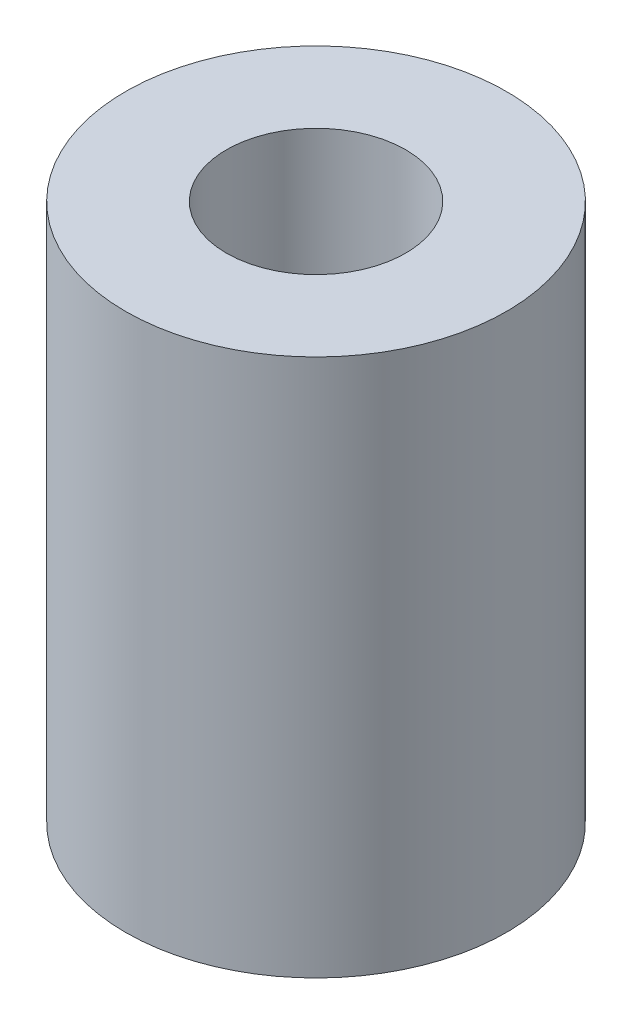
ISO-10303-21;
HEADER;
FILE_DESCRIPTION(('STEP AP214'),'2;1');
FILE_NAME('part.step','',(''),(''),'','','');
FILE_SCHEMA(('AUTOMOTIVE_DESIGN { 1 0 10303 214 1 1 1 1 }'));
ENDSEC;
DATA;
#1=APPLICATION_CONTEXT('core data for automotive mechanical design processes');
#2=APPLICATION_PROTOCOL_DEFINITION('international standard','automotive_design',2000,#1);
#3=PRODUCT_CONTEXT('',#1,'mechanical');
#4=PRODUCT('Part','Part','',(#3));
#5=PRODUCT_RELATED_PRODUCT_CATEGORY('part','',(#4));
#6=PRODUCT_DEFINITION_FORMATION('','',#4);
#7=PRODUCT_DEFINITION_CONTEXT('part definition',#1,'design');
#8=PRODUCT_DEFINITION('design','',#6,#7);
#9=PRODUCT_DEFINITION_SHAPE('','',#8);
#10=(LENGTH_UNIT() NAMED_UNIT(*) SI_UNIT(.MILLI.,.METRE.));
#11=(NAMED_UNIT(*) PLANE_ANGLE_UNIT() SI_UNIT($,.RADIAN.));
#12=(NAMED_UNIT(*) SI_UNIT($,.STERADIAN.) SOLID_ANGLE_UNIT());
#13=UNCERTAINTY_MEASURE_WITH_UNIT(LENGTH_MEASURE(1.E-05),#10,'distance_accuracy_value','');
#14=(GEOMETRIC_REPRESENTATION_CONTEXT(3) GLOBAL_UNCERTAINTY_ASSIGNED_CONTEXT((#13)) GLOBAL_UNIT_ASSIGNED_CONTEXT((#10,
#11,#12)) REPRESENTATION_CONTEXT('',''));
#15=CARTESIAN_POINT('',(0.,0.,0.));
#16=DIRECTION('',(0.,0.,1.));
#17=DIRECTION('',(1.,0.,0.));
#18=AXIS2_PLACEMENT_3D('',#15,#16,#17);
#19=CARTESIAN_POINT('',(0.,6.,0.));
#20=DIRECTION('',(0.,1.,0.));
#21=DIRECTION('',(0.,0.,1.));
#22=AXIS2_PLACEMENT_3D('',#19,#20,#21);
#23=PLANE('',#22);
#24=CARTESIAN_POINT('',(0.,6.,0.));
#25=DIRECTION('',(0.,1.,0.));
#26=DIRECTION('',(0.,0.,1.));
#27=AXIS2_PLACEMENT_3D('',#24,#25,#26);
#28=CIRCLE('',#27,2.125);
#29=CARTESIAN_POINT('',(0.,6.,2.125));
#30=VERTEX_POINT('',#29);
#31=EDGE_CURVE('E10',#30,#30,#28,.T.);
#32=ORIENTED_EDGE('',*,*,#31,.T.);
#33=EDGE_LOOP('',(#32));
#34=FACE_BOUND('',#33,.T.);
#35=CARTESIAN_POINT('',(0.,6.,0.));
#36=DIRECTION('',(0.,1.,0.));
#37=DIRECTION('',(0.,0.,1.));
#38=AXIS2_PLACEMENT_3D('',#35,#36,#37);
#39=CIRCLE('',#38,1.);
#40=CARTESIAN_POINT('',(0.,6.,1.));
#41=VERTEX_POINT('',#40);
#42=EDGE_CURVE('E52',#41,#41,#39,.T.);
#43=ORIENTED_EDGE('',*,*,#42,.F.);
#44=EDGE_LOOP('',(#43));
#45=FACE_BOUND('',#44,.T.);
#46=ADVANCED_FACE('F37',(#34,#45),#23,.T.);
#47=CARTESIAN_POINT('',(0.,0.,0.));
#48=DIRECTION('',(0.,1.,0.));
#49=DIRECTION('',(0.,0.,1.));
#50=AXIS2_PLACEMENT_3D('',#47,#48,#49);
#51=PLANE('',#50);
#52=CARTESIAN_POINT('',(0.,0.,0.));
#53=DIRECTION('',(0.,1.,0.));
#54=DIRECTION('',(0.,0.,1.));
#55=AXIS2_PLACEMENT_3D('',#52,#53,#54);
#56=CIRCLE('',#55,2.125);
#57=CARTESIAN_POINT('',(0.,0.,2.125));
#58=VERTEX_POINT('',#57);
#59=EDGE_CURVE('E41',#58,#58,#56,.T.);
#60=ORIENTED_EDGE('',*,*,#59,.F.);
#61=EDGE_LOOP('',(#60));
#62=FACE_BOUND('',#61,.T.);
#63=CARTESIAN_POINT('',(0.,0.,0.));
#64=DIRECTION('',(0.,1.,0.));
#65=DIRECTION('',(0.,0.,1.));
#66=AXIS2_PLACEMENT_3D('',#63,#64,#65);
#67=CIRCLE('',#66,1.);
#68=CARTESIAN_POINT('',(0.,0.,1.));
#69=VERTEX_POINT('',#68);
#70=EDGE_CURVE('E54',#69,#69,#67,.T.);
#71=ORIENTED_EDGE('',*,*,#70,.T.);
#72=EDGE_LOOP('',(#71));
#73=FACE_BOUND('',#72,.T.);
#74=ADVANCED_FACE('F68',(#62,#73),#51,.F.);
#75=CARTESIAN_POINT('',(0.,6.,0.));
#76=DIRECTION('',(0.,-1.,0.));
#77=DIRECTION('',(0.,0.,-1.));
#78=AXIS2_PLACEMENT_3D('',#75,#76,#77);
#79=CYLINDRICAL_SURFACE('',#78,2.125);
#80=ORIENTED_EDGE('',*,*,#31,.F.);
#81=EDGE_LOOP('',(#80));
#82=FACE_BOUND('',#81,.T.);
#83=ORIENTED_EDGE('',*,*,#59,.T.);
#84=EDGE_LOOP('',(#83));
#85=FACE_BOUND('',#84,.T.);
#86=ADVANCED_FACE('F39',(#82,#85),#79,.T.);
#87=CARTESIAN_POINT('',(0.,6.,0.));
#88=DIRECTION('',(0.,-1.,0.));
#89=DIRECTION('',(0.,0.,-1.));
#90=AXIS2_PLACEMENT_3D('',#87,#88,#89);
#91=CYLINDRICAL_SURFACE('',#90,1.);
#92=ORIENTED_EDGE('',*,*,#42,.T.);
#93=EDGE_LOOP('',(#92));
#94=FACE_BOUND('',#93,.T.);
#95=ORIENTED_EDGE('',*,*,#70,.F.);
#96=EDGE_LOOP('',(#95));
#97=FACE_BOUND('',#96,.T.);
#98=ADVANCED_FACE('F64',(#94,#97),#91,.F.);
#99=CLOSED_SHELL('',(#46,#74,#86,#98));
#100=MANIFOLD_SOLID_BREP('B2',#99);
#101=ADVANCED_BREP_SHAPE_REPRESENTATION('',(#18,#100),#14);
#102=SHAPE_DEFINITION_REPRESENTATION(#9,#101);
ENDSEC;
END-ISO-10303-21;
